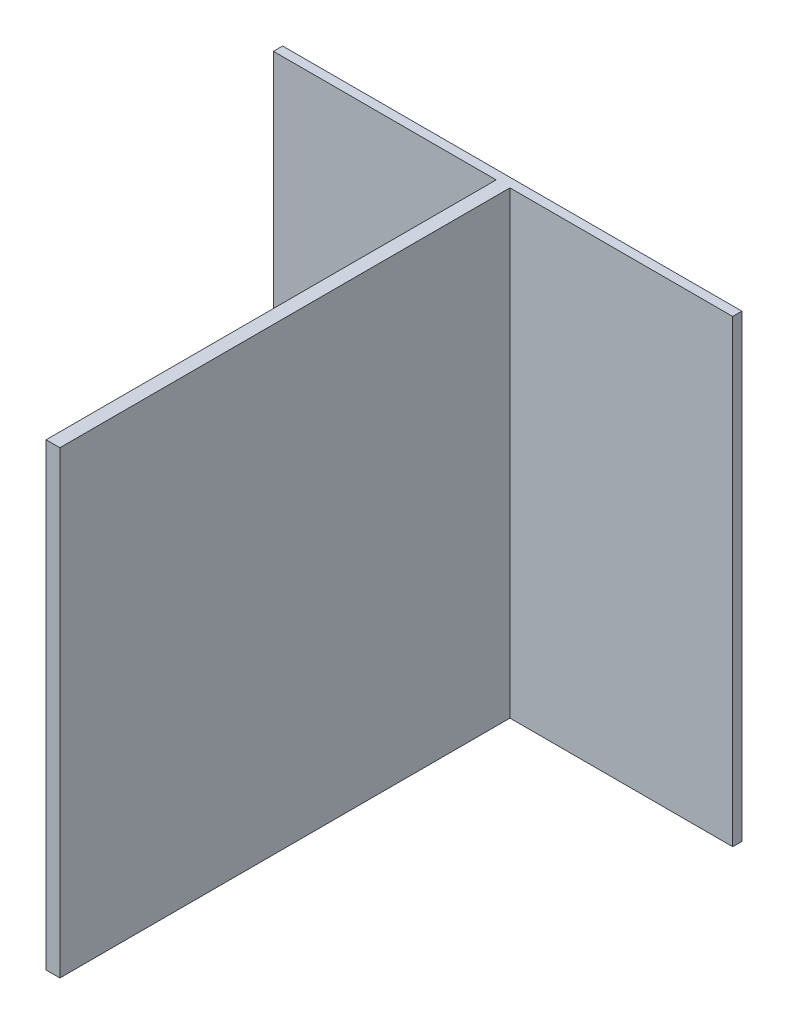
ISO-10303-21;
HEADER;
FILE_DESCRIPTION(('STEP AP214'),'2;1');
FILE_NAME('part.step','',(''),(''),'','','');
FILE_SCHEMA(('AUTOMOTIVE_DESIGN { 1 0 10303 214 1 1 1 1 }'));
ENDSEC;
DATA;
#1=APPLICATION_CONTEXT('core data for automotive mechanical design processes');
#2=APPLICATION_PROTOCOL_DEFINITION('international standard','automotive_design',2000,#1);
#3=PRODUCT_CONTEXT('',#1,'mechanical');
#4=PRODUCT('Part','Part','',(#3));
#5=PRODUCT_RELATED_PRODUCT_CATEGORY('part','',(#4));
#6=PRODUCT_DEFINITION_FORMATION('','',#4);
#7=PRODUCT_DEFINITION_CONTEXT('part definition',#1,'design');
#8=PRODUCT_DEFINITION('design','',#6,#7);
#9=PRODUCT_DEFINITION_SHAPE('','',#8);
#10=(LENGTH_UNIT() NAMED_UNIT(*) SI_UNIT(.MILLI.,.METRE.));
#11=(NAMED_UNIT(*) PLANE_ANGLE_UNIT() SI_UNIT($,.RADIAN.));
#12=(NAMED_UNIT(*) SI_UNIT($,.STERADIAN.) SOLID_ANGLE_UNIT());
#13=UNCERTAINTY_MEASURE_WITH_UNIT(LENGTH_MEASURE(1.E-05),#10,'distance_accuracy_value','');
#14=(GEOMETRIC_REPRESENTATION_CONTEXT(3) GLOBAL_UNCERTAINTY_ASSIGNED_CONTEXT((#13)) GLOBAL_UNIT_ASSIGNED_CONTEXT((#10,
#11,#12)) REPRESENTATION_CONTEXT('',''));
#15=CARTESIAN_POINT('',(0.,0.,0.));
#16=DIRECTION('',(0.,0.,1.));
#17=DIRECTION('',(1.,0.,0.));
#18=AXIS2_PLACEMENT_3D('',#15,#16,#17);
#19=CARTESIAN_POINT('',(0.,0.,4.));
#20=DIRECTION('',(0.,0.,1.));
#21=DIRECTION('',(1.,0.,0.));
#22=AXIS2_PLACEMENT_3D('',#19,#20,#21);
#23=PLANE('',#22);
#24=DIRECTION('',(-1.,0.,0.));
#25=VECTOR('',#24,1.);
#26=CARTESIAN_POINT('',(0.,-100.,4.));
#27=LINE('',#26,#25);
#28=CARTESIAN_POINT('',(-3.,-100.,4.));
#29=VERTEX_POINT('',#28);
#30=CARTESIAN_POINT('',(-100.,-100.,4.));
#31=VERTEX_POINT('',#30);
#32=EDGE_CURVE('E62',#29,#31,#27,.T.);
#33=ORIENTED_EDGE('',*,*,#32,.F.);
#34=DIRECTION('',(0.,1.,0.));
#35=VECTOR('',#34,1.);
#36=CARTESIAN_POINT('',(-3.,0.,4.));
#37=LINE('',#36,#35);
#38=CARTESIAN_POINT('',(-3.,100.,4.));
#39=VERTEX_POINT('',#38);
#40=EDGE_CURVE('E57',#29,#39,#37,.T.);
#41=ORIENTED_EDGE('',*,*,#40,.T.);
#42=DIRECTION('',(-1.,0.,0.));
#43=VECTOR('',#42,1.);
#44=CARTESIAN_POINT('',(0.,100.,4.));
#45=LINE('',#44,#43);
#46=CARTESIAN_POINT('',(-100.,100.,4.));
#47=VERTEX_POINT('',#46);
#48=EDGE_CURVE('E149',#39,#47,#45,.T.);
#49=ORIENTED_EDGE('',*,*,#48,.T.);
#50=DIRECTION('',(0.,-1.,0.));
#51=VECTOR('',#50,1.);
#52=CARTESIAN_POINT('',(-100.,0.,4.));
#53=LINE('',#52,#51);
#54=EDGE_CURVE('E153',#47,#31,#53,.T.);
#55=ORIENTED_EDGE('',*,*,#54,.T.);
#56=EDGE_LOOP('',(#33,#41,#49,#55));
#57=FACE_BOUND('',#56,.T.);
#58=ADVANCED_FACE('F41',(#57),#23,.T.);
#59=CARTESIAN_POINT('',(0.,-100.,4.));
#60=DIRECTION('',(0.,-1.,0.));
#61=DIRECTION('',(0.,0.,-1.));
#62=AXIS2_PLACEMENT_3D('',#59,#60,#61);
#63=PLANE('',#62);
#64=DIRECTION('',(-1.,0.,0.));
#65=VECTOR('',#64,1.);
#66=CARTESIAN_POINT('',(0.,-100.,0.));
#67=LINE('',#66,#65);
#68=CARTESIAN_POINT('',(100.,-100.,0.));
#69=VERTEX_POINT('',#68);
#70=CARTESIAN_POINT('',(-100.,-100.,0.));
#71=VERTEX_POINT('',#70);
#72=EDGE_CURVE('E132',#69,#71,#67,.T.);
#73=ORIENTED_EDGE('',*,*,#72,.F.);
#74=DIRECTION('',(0.,0.,-1.));
#75=VECTOR('',#74,1.);
#76=CARTESIAN_POINT('',(100.,-100.,4.));
#77=LINE('',#76,#75);
#78=CARTESIAN_POINT('',(100.,-100.,4.));
#79=VERTEX_POINT('',#78);
#80=EDGE_CURVE('E11',#79,#69,#77,.T.);
#81=ORIENTED_EDGE('',*,*,#80,.F.);
#82=CARTESIAN_POINT('',(3.,-100.,4.));
#83=VERTEX_POINT('',#82);
#84=EDGE_CURVE('E130',#79,#83,#27,.T.);
#85=ORIENTED_EDGE('',*,*,#84,.T.);
#86=DIRECTION('',(0.,0.,-1.));
#87=VECTOR('',#86,1.);
#88=CARTESIAN_POINT('',(3.00000000000001,-100.,200.));
#89=LINE('',#88,#87);
#90=CARTESIAN_POINT('',(3.00000000000001,-100.,200.));
#91=VERTEX_POINT('',#90);
#92=EDGE_CURVE('E110',#91,#83,#89,.T.);
#93=ORIENTED_EDGE('',*,*,#92,.F.);
#94=DIRECTION('',(1.,0.,0.));
#95=VECTOR('',#94,1.);
#96=CARTESIAN_POINT('',(0.,-100.,200.));
#97=LINE('',#96,#95);
#98=CARTESIAN_POINT('',(-2.99999999999999,-100.,200.));
#99=VERTEX_POINT('',#98);
#100=EDGE_CURVE('E117',#99,#91,#97,.T.);
#101=ORIENTED_EDGE('',*,*,#100,.F.);
#102=DIRECTION('',(0.,0.,-1.));
#103=VECTOR('',#102,1.);
#104=CARTESIAN_POINT('',(-2.99999999999999,-100.,200.));
#105=LINE('',#104,#103);
#106=EDGE_CURVE('E195',#99,#29,#105,.T.);
#107=ORIENTED_EDGE('',*,*,#106,.T.);
#108=ORIENTED_EDGE('',*,*,#32,.T.);
#109=DIRECTION('',(0.,0.,-1.));
#110=VECTOR('',#109,1.);
#111=CARTESIAN_POINT('',(-100.,-100.,4.));
#112=LINE('',#111,#110);
#113=EDGE_CURVE('E155',#31,#71,#112,.T.);
#114=ORIENTED_EDGE('',*,*,#113,.T.);
#115=EDGE_LOOP('',(#73,#81,#85,#93,#101,#107,#108,#114));
#116=FACE_BOUND('',#115,.T.);
#117=ADVANCED_FACE('F43',(#116),#63,.T.);
#118=CARTESIAN_POINT('',(100.,0.,4.));
#119=DIRECTION('',(1.,0.,0.));
#120=DIRECTION('',(0.,0.,-1.));
#121=AXIS2_PLACEMENT_3D('',#118,#119,#120);
#122=PLANE('',#121);
#123=DIRECTION('',(0.,-1.,0.));
#124=VECTOR('',#123,1.);
#125=CARTESIAN_POINT('',(100.,0.,0.));
#126=LINE('',#125,#124);
#127=CARTESIAN_POINT('',(100.,100.,0.));
#128=VERTEX_POINT('',#127);
#129=EDGE_CURVE('E137',#128,#69,#126,.T.);
#130=ORIENTED_EDGE('',*,*,#129,.F.);
#131=DIRECTION('',(0.,0.,-1.));
#132=VECTOR('',#131,1.);
#133=CARTESIAN_POINT('',(100.,100.,4.));
#134=LINE('',#133,#132);
#135=CARTESIAN_POINT('',(100.,100.,4.));
#136=VERTEX_POINT('',#135);
#137=EDGE_CURVE('E50',#136,#128,#134,.T.);
#138=ORIENTED_EDGE('',*,*,#137,.F.);
#139=DIRECTION('',(0.,-1.,0.));
#140=VECTOR('',#139,1.);
#141=CARTESIAN_POINT('',(100.,0.,4.));
#142=LINE('',#141,#140);
#143=EDGE_CURVE('E145',#136,#79,#142,.T.);
#144=ORIENTED_EDGE('',*,*,#143,.T.);
#145=ORIENTED_EDGE('',*,*,#80,.T.);
#146=EDGE_LOOP('',(#130,#138,#144,#145));
#147=FACE_BOUND('',#146,.T.);
#148=ADVANCED_FACE('F184',(#147),#122,.T.);
#149=CARTESIAN_POINT('',(0.,100.,4.));
#150=DIRECTION('',(0.,-1.,0.));
#151=DIRECTION('',(0.,0.,-1.));
#152=AXIS2_PLACEMENT_3D('',#149,#150,#151);
#153=PLANE('',#152);
#154=DIRECTION('',(-1.,0.,0.));
#155=VECTOR('',#154,1.);
#156=CARTESIAN_POINT('',(0.,100.,0.));
#157=LINE('',#156,#155);
#158=CARTESIAN_POINT('',(-100.,100.,0.));
#159=VERTEX_POINT('',#158);
#160=EDGE_CURVE('E160',#128,#159,#157,.T.);
#161=ORIENTED_EDGE('',*,*,#160,.T.);
#162=DIRECTION('',(0.,0.,-1.));
#163=VECTOR('',#162,1.);
#164=CARTESIAN_POINT('',(-100.,100.,4.));
#165=LINE('',#164,#163);
#166=EDGE_CURVE('E169',#47,#159,#165,.T.);
#167=ORIENTED_EDGE('',*,*,#166,.F.);
#168=ORIENTED_EDGE('',*,*,#48,.F.);
#169=DIRECTION('',(0.,0.,-1.));
#170=VECTOR('',#169,1.);
#171=CARTESIAN_POINT('',(-3.,100.,200.));
#172=LINE('',#171,#170);
#173=CARTESIAN_POINT('',(-3.,100.,200.));
#174=VERTEX_POINT('',#173);
#175=EDGE_CURVE('E139',#174,#39,#172,.T.);
#176=ORIENTED_EDGE('',*,*,#175,.F.);
#177=DIRECTION('',(-1.,0.,0.));
#178=VECTOR('',#177,1.);
#179=CARTESIAN_POINT('',(0.,100.,200.));
#180=LINE('',#179,#178);
#181=CARTESIAN_POINT('',(3.,100.,200.));
#182=VERTEX_POINT('',#181);
#183=EDGE_CURVE('E116',#182,#174,#180,.T.);
#184=ORIENTED_EDGE('',*,*,#183,.F.);
#185=DIRECTION('',(0.,0.,-1.));
#186=VECTOR('',#185,1.);
#187=CARTESIAN_POINT('',(3.,100.,200.));
#188=LINE('',#187,#186);
#189=CARTESIAN_POINT('',(3.,100.,4.));
#190=VERTEX_POINT('',#189);
#191=EDGE_CURVE('E112',#182,#190,#188,.T.);
#192=ORIENTED_EDGE('',*,*,#191,.T.);
#193=EDGE_CURVE('E150',#136,#190,#45,.T.);
#194=ORIENTED_EDGE('',*,*,#193,.F.);
#195=ORIENTED_EDGE('',*,*,#137,.T.);
#196=EDGE_LOOP('',(#161,#167,#168,#176,#184,#192,#194,#195));
#197=FACE_BOUND('',#196,.T.);
#198=ADVANCED_FACE('F176',(#197),#153,.F.);
#199=CARTESIAN_POINT('',(-100.,0.,4.));
#200=DIRECTION('',(1.,0.,0.));
#201=DIRECTION('',(0.,0.,-1.));
#202=AXIS2_PLACEMENT_3D('',#199,#200,#201);
#203=PLANE('',#202);
#204=DIRECTION('',(0.,-1.,0.));
#205=VECTOR('',#204,1.);
#206=CARTESIAN_POINT('',(-100.,0.,0.));
#207=LINE('',#206,#205);
#208=EDGE_CURVE('E163',#159,#71,#207,.T.);
#209=ORIENTED_EDGE('',*,*,#208,.T.);
#210=ORIENTED_EDGE('',*,*,#113,.F.);
#211=ORIENTED_EDGE('',*,*,#54,.F.);
#212=ORIENTED_EDGE('',*,*,#166,.T.);
#213=EDGE_LOOP('',(#209,#210,#211,#212));
#214=FACE_BOUND('',#213,.T.);
#215=ADVANCED_FACE('F188',(#214),#203,.F.);
#216=DIRECTION('',(0.,1.,0.));
#217=VECTOR('',#216,1.);
#218=CARTESIAN_POINT('',(3.,0.,4.));
#219=LINE('',#218,#217);
#220=EDGE_CURVE('E201',#83,#190,#219,.T.);
#221=ORIENTED_EDGE('',*,*,#220,.F.);
#222=ORIENTED_EDGE('',*,*,#84,.F.);
#223=ORIENTED_EDGE('',*,*,#143,.F.);
#224=ORIENTED_EDGE('',*,*,#193,.T.);
#225=EDGE_LOOP('',(#221,#222,#223,#224));
#226=FACE_BOUND('',#225,.T.);
#227=ADVANCED_FACE('F208',(#226),#23,.T.);
#228=CARTESIAN_POINT('',(0.,0.,0.));
#229=DIRECTION('',(0.,0.,1.));
#230=DIRECTION('',(1.,0.,0.));
#231=AXIS2_PLACEMENT_3D('',#228,#229,#230);
#232=PLANE('',#231);
#233=ORIENTED_EDGE('',*,*,#72,.T.);
#234=ORIENTED_EDGE('',*,*,#208,.F.);
#235=ORIENTED_EDGE('',*,*,#160,.F.);
#236=ORIENTED_EDGE('',*,*,#129,.T.);
#237=EDGE_LOOP('',(#233,#234,#235,#236));
#238=FACE_BOUND('',#237,.T.);
#239=ADVANCED_FACE('F183',(#238),#232,.F.);
#240=CARTESIAN_POINT('',(3.,0.,200.));
#241=DIRECTION('',(-1.,0.,0.));
#242=DIRECTION('',(0.,0.,1.));
#243=AXIS2_PLACEMENT_3D('',#240,#241,#242);
#244=PLANE('',#243);
#245=ORIENTED_EDGE('',*,*,#220,.T.);
#246=ORIENTED_EDGE('',*,*,#191,.F.);
#247=DIRECTION('',(0.,1.,0.));
#248=VECTOR('',#247,1.);
#249=CARTESIAN_POINT('',(3.,0.,200.));
#250=LINE('',#249,#248);
#251=EDGE_CURVE('E105',#91,#182,#250,.T.);
#252=ORIENTED_EDGE('',*,*,#251,.F.);
#253=ORIENTED_EDGE('',*,*,#92,.T.);
#254=EDGE_LOOP('',(#245,#246,#252,#253));
#255=FACE_BOUND('',#254,.T.);
#256=ADVANCED_FACE('F108',(#255),#244,.F.);
#257=CARTESIAN_POINT('',(-3.,0.,200.));
#258=DIRECTION('',(-1.,0.,0.));
#259=DIRECTION('',(0.,0.,1.));
#260=AXIS2_PLACEMENT_3D('',#257,#258,#259);
#261=PLANE('',#260);
#262=ORIENTED_EDGE('',*,*,#40,.F.);
#263=ORIENTED_EDGE('',*,*,#106,.F.);
#264=DIRECTION('',(0.,1.,0.));
#265=VECTOR('',#264,1.);
#266=CARTESIAN_POINT('',(-3.,0.,200.));
#267=LINE('',#266,#265);
#268=EDGE_CURVE('E123',#99,#174,#267,.T.);
#269=ORIENTED_EDGE('',*,*,#268,.T.);
#270=ORIENTED_EDGE('',*,*,#175,.T.);
#271=EDGE_LOOP('',(#262,#263,#269,#270));
#272=FACE_BOUND('',#271,.T.);
#273=ADVANCED_FACE('F193',(#272),#261,.T.);
#274=CARTESIAN_POINT('',(0.,0.,200.));
#275=DIRECTION('',(0.,0.,1.));
#276=DIRECTION('',(1.,0.,0.));
#277=AXIS2_PLACEMENT_3D('',#274,#275,#276);
#278=PLANE('',#277);
#279=ORIENTED_EDGE('',*,*,#100,.T.);
#280=ORIENTED_EDGE('',*,*,#251,.T.);
#281=ORIENTED_EDGE('',*,*,#183,.T.);
#282=ORIENTED_EDGE('',*,*,#268,.F.);
#283=EDGE_LOOP('',(#279,#280,#281,#282));
#284=FACE_BOUND('',#283,.T.);
#285=ADVANCED_FACE('F121',(#284),#278,.T.);
#286=CLOSED_SHELL('',(#58,#117,#148,#198,#215,#227,#239,#256,#273,#285));
#287=MANIFOLD_SOLID_BREP('B2',#286);
#288=ADVANCED_BREP_SHAPE_REPRESENTATION('',(#18,#287),#14);
#289=SHAPE_DEFINITION_REPRESENTATION(#9,#288);
ENDSEC;
END-ISO-10303-21;
